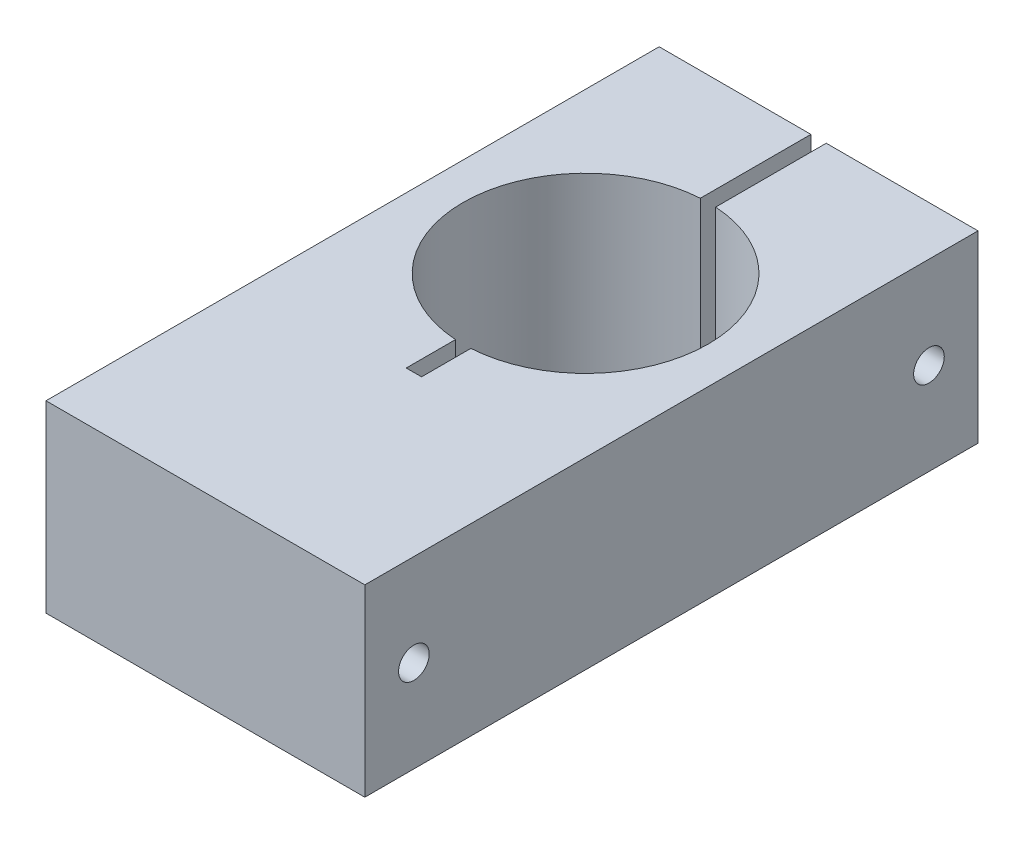
ISO-10303-21;
HEADER;
FILE_DESCRIPTION(('STEP AP214'),'2;1');
FILE_NAME('part.step','',(''),(''),'','','');
FILE_SCHEMA(('AUTOMOTIVE_DESIGN { 1 0 10303 214 1 1 1 1 }'));
ENDSEC;
DATA;
#1=APPLICATION_CONTEXT('core data for automotive mechanical design processes');
#2=APPLICATION_PROTOCOL_DEFINITION('international standard','automotive_design',2000,#1);
#3=PRODUCT_CONTEXT('',#1,'mechanical');
#4=PRODUCT('Part','Part','',(#3));
#5=PRODUCT_RELATED_PRODUCT_CATEGORY('part','',(#4));
#6=PRODUCT_DEFINITION_FORMATION('','',#4);
#7=PRODUCT_DEFINITION_CONTEXT('part definition',#1,'design');
#8=PRODUCT_DEFINITION('design','',#6,#7);
#9=PRODUCT_DEFINITION_SHAPE('','',#8);
#10=(LENGTH_UNIT() NAMED_UNIT(*) SI_UNIT(.MILLI.,.METRE.));
#11=(NAMED_UNIT(*) PLANE_ANGLE_UNIT() SI_UNIT($,.RADIAN.));
#12=(NAMED_UNIT(*) SI_UNIT($,.STERADIAN.) SOLID_ANGLE_UNIT());
#13=UNCERTAINTY_MEASURE_WITH_UNIT(LENGTH_MEASURE(1.E-05),#10,'distance_accuracy_value','');
#14=(GEOMETRIC_REPRESENTATION_CONTEXT(3) GLOBAL_UNCERTAINTY_ASSIGNED_CONTEXT((#13)) GLOBAL_UNIT_ASSIGNED_CONTEXT((#10,
#11,#12)) REPRESENTATION_CONTEXT('',''));
#15=CARTESIAN_POINT('',(0.,0.,0.));
#16=DIRECTION('',(0.,0.,1.));
#17=DIRECTION('',(1.,0.,0.));
#18=AXIS2_PLACEMENT_3D('',#15,#16,#17);
#19=CARTESIAN_POINT('',(0.79375,0.,-31.75));
#20=DIRECTION('',(1.,0.,0.));
#21=DIRECTION('',(0.,0.,-1.));
#22=AXIS2_PLACEMENT_3D('',#19,#20,#21);
#23=PLANE('',#22);
#24=CARTESIAN_POINT('',(0.793749999999999,9.525,-26.67));
#25=DIRECTION('',(1.,0.,0.));
#26=DIRECTION('',(0.,0.,-1.));
#27=AXIS2_PLACEMENT_3D('',#24,#25,#26);
#28=CIRCLE('',#27,1.5875);
#29=CARTESIAN_POINT('',(0.793749999999999,9.525,-28.2575));
#30=VERTEX_POINT('',#29);
#31=EDGE_CURVE('E223',#30,#30,#28,.T.);
#32=ORIENTED_EDGE('',*,*,#31,.T.);
#33=EDGE_LOOP('',(#32));
#34=FACE_BOUND('',#33,.T.);
#35=DIRECTION('',(0.,0.,-1.));
#36=VECTOR('',#35,1.);
#37=CARTESIAN_POINT('',(0.79375,0.,-31.75));
#38=LINE('',#37,#36);
#39=CARTESIAN_POINT('',(0.79375,0.,-20.2951710417454));
#40=VERTEX_POINT('',#39);
#41=CARTESIAN_POINT('',(0.79375,0.,-31.75));
#42=VERTEX_POINT('',#41);
#43=EDGE_CURVE('E210',#40,#42,#38,.T.);
#44=ORIENTED_EDGE('',*,*,#43,.F.);
#45=DIRECTION('',(0.,1.,0.));
#46=VECTOR('',#45,1.);
#47=CARTESIAN_POINT('',(0.79375,0.,-20.2951710417454));
#48=LINE('',#47,#46);
#49=CARTESIAN_POINT('',(0.79375,19.05,-20.2951710417454));
#50=VERTEX_POINT('',#49);
#51=EDGE_CURVE('E129',#40,#50,#48,.T.);
#52=ORIENTED_EDGE('',*,*,#51,.T.);
#53=DIRECTION('',(0.,0.,-1.));
#54=VECTOR('',#53,1.);
#55=CARTESIAN_POINT('',(0.79375,19.05,-31.75));
#56=LINE('',#55,#54);
#57=CARTESIAN_POINT('',(0.79375,19.05,-31.75));
#58=VERTEX_POINT('',#57);
#59=EDGE_CURVE('E138',#50,#58,#56,.T.);
#60=ORIENTED_EDGE('',*,*,#59,.T.);
#61=DIRECTION('',(0.,1.,0.));
#62=VECTOR('',#61,1.);
#63=CARTESIAN_POINT('',(0.79375,0.,-31.75));
#64=LINE('',#63,#62);
#65=EDGE_CURVE('E152',#42,#58,#64,.T.);
#66=ORIENTED_EDGE('',*,*,#65,.F.);
#67=EDGE_LOOP('',(#44,#52,#60,#66));
#68=FACE_BOUND('',#67,.T.);
#69=ADVANCED_FACE('F33',(#34,#68),#23,.F.);
#70=CARTESIAN_POINT('',(-0.79375,0.,-31.75));
#71=DIRECTION('',(-1.,0.,0.));
#72=DIRECTION('',(0.,0.,1.));
#73=AXIS2_PLACEMENT_3D('',#70,#71,#72);
#74=PLANE('',#73);
#75=DIRECTION('',(0.,0.,1.));
#76=VECTOR('',#75,1.);
#77=CARTESIAN_POINT('',(-0.79375,0.,-31.75));
#78=LINE('',#77,#76);
#79=CARTESIAN_POINT('',(-0.793749999999996,0.,5.05517104174533));
#80=VERTEX_POINT('',#79);
#81=CARTESIAN_POINT('',(-0.793749999999995,0.,10.16));
#82=VERTEX_POINT('',#81);
#83=EDGE_CURVE('E144',#80,#82,#78,.T.);
#84=ORIENTED_EDGE('',*,*,#83,.F.);
#85=DIRECTION('',(0.,1.,0.));
#86=VECTOR('',#85,1.);
#87=CARTESIAN_POINT('',(-0.793749999999995,0.,5.05517104174533));
#88=LINE('',#87,#86);
#89=CARTESIAN_POINT('',(-0.793749999999996,19.05,5.05517104174533));
#90=VERTEX_POINT('',#89);
#91=EDGE_CURVE('E11',#80,#90,#88,.T.);
#92=ORIENTED_EDGE('',*,*,#91,.T.);
#93=DIRECTION('',(0.,0.,1.));
#94=VECTOR('',#93,1.);
#95=CARTESIAN_POINT('',(-0.79375,19.05,-31.75));
#96=LINE('',#95,#94);
#97=CARTESIAN_POINT('',(-0.793749999999995,19.05,10.16));
#98=VERTEX_POINT('',#97);
#99=EDGE_CURVE('E214',#90,#98,#96,.T.);
#100=ORIENTED_EDGE('',*,*,#99,.T.);
#101=DIRECTION('',(0.,1.,0.));
#102=VECTOR('',#101,1.);
#103=CARTESIAN_POINT('',(-0.793749999999995,0.,10.16));
#104=LINE('',#103,#102);
#105=EDGE_CURVE('E157',#82,#98,#104,.T.);
#106=ORIENTED_EDGE('',*,*,#105,.F.);
#107=EDGE_LOOP('',(#84,#92,#100,#106));
#108=FACE_BOUND('',#107,.T.);
#109=ADVANCED_FACE('F264',(#108),#74,.F.);
#110=CARTESIAN_POINT('',(-16.51,19.05,-31.75));
#111=DIRECTION('',(0.,0.,1.));
#112=DIRECTION('',(1.,0.,0.));
#113=AXIS2_PLACEMENT_3D('',#110,#111,#112);
#114=PLANE('',#113);
#115=DIRECTION('',(-1.,0.,0.));
#116=VECTOR('',#115,1.);
#117=CARTESIAN_POINT('',(-16.51,0.,-31.75));
#118=LINE('',#117,#116);
#119=CARTESIAN_POINT('',(16.51,0.,-31.75));
#120=VERTEX_POINT('',#119);
#121=EDGE_CURVE('E178',#120,#42,#118,.T.);
#122=ORIENTED_EDGE('',*,*,#121,.T.);
#123=ORIENTED_EDGE('',*,*,#65,.T.);
#124=DIRECTION('',(-1.,0.,0.));
#125=VECTOR('',#124,1.);
#126=CARTESIAN_POINT('',(-16.51,19.05,-31.75));
#127=LINE('',#126,#125);
#128=CARTESIAN_POINT('',(16.51,19.05,-31.75));
#129=VERTEX_POINT('',#128);
#130=EDGE_CURVE('E168',#129,#58,#127,.T.);
#131=ORIENTED_EDGE('',*,*,#130,.F.);
#132=DIRECTION('',(0.,-1.,0.));
#133=VECTOR('',#132,1.);
#134=CARTESIAN_POINT('',(16.51,19.05,-31.75));
#135=LINE('',#134,#133);
#136=EDGE_CURVE('E192',#129,#120,#135,.T.);
#137=ORIENTED_EDGE('',*,*,#136,.T.);
#138=EDGE_LOOP('',(#122,#123,#131,#137));
#139=FACE_BOUND('',#138,.T.);
#140=ADVANCED_FACE('F244',(#139),#114,.F.);
#141=CARTESIAN_POINT('',(16.51,19.05,-31.75));
#142=DIRECTION('',(-1.,0.,0.));
#143=DIRECTION('',(0.,0.,1.));
#144=AXIS2_PLACEMENT_3D('',#141,#142,#143);
#145=PLANE('',#144);
#146=CARTESIAN_POINT('',(16.51,9.525,26.67));
#147=DIRECTION('',(1.,0.,0.));
#148=DIRECTION('',(0.,0.,-1.));
#149=AXIS2_PLACEMENT_3D('',#146,#147,#148);
#150=CIRCLE('',#149,1.5875);
#151=CARTESIAN_POINT('',(16.51,9.525,25.0825));
#152=VERTEX_POINT('',#151);
#153=EDGE_CURVE('E229',#152,#152,#150,.T.);
#154=ORIENTED_EDGE('',*,*,#153,.F.);
#155=EDGE_LOOP('',(#154));
#156=FACE_BOUND('',#155,.T.);
#157=CARTESIAN_POINT('',(16.51,9.525,-26.67));
#158=DIRECTION('',(1.,0.,0.));
#159=DIRECTION('',(0.,0.,-1.));
#160=AXIS2_PLACEMENT_3D('',#157,#158,#159);
#161=CIRCLE('',#160,1.5875);
#162=CARTESIAN_POINT('',(16.51,9.525,-28.2575));
#163=VERTEX_POINT('',#162);
#164=EDGE_CURVE('E230',#163,#163,#161,.T.);
#165=ORIENTED_EDGE('',*,*,#164,.F.);
#166=EDGE_LOOP('',(#165));
#167=FACE_BOUND('',#166,.T.);
#168=DIRECTION('',(0.,0.,-1.));
#169=VECTOR('',#168,1.);
#170=CARTESIAN_POINT('',(16.51,0.,-31.75));
#171=LINE('',#170,#169);
#172=CARTESIAN_POINT('',(16.51,0.,31.75));
#173=VERTEX_POINT('',#172);
#174=EDGE_CURVE('E155',#173,#120,#171,.T.);
#175=ORIENTED_EDGE('',*,*,#174,.T.);
#176=ORIENTED_EDGE('',*,*,#136,.F.);
#177=DIRECTION('',(0.,0.,-1.));
#178=VECTOR('',#177,1.);
#179=CARTESIAN_POINT('',(16.51,19.05,-31.75));
#180=LINE('',#179,#178);
#181=CARTESIAN_POINT('',(16.51,19.05,31.75));
#182=VERTEX_POINT('',#181);
#183=EDGE_CURVE('E163',#182,#129,#180,.T.);
#184=ORIENTED_EDGE('',*,*,#183,.F.);
#185=DIRECTION('',(0.,-1.,0.));
#186=VECTOR('',#185,1.);
#187=CARTESIAN_POINT('',(16.51,19.05,31.75));
#188=LINE('',#187,#186);
#189=EDGE_CURVE('E174',#182,#173,#188,.T.);
#190=ORIENTED_EDGE('',*,*,#189,.T.);
#191=EDGE_LOOP('',(#175,#176,#184,#190));
#192=FACE_BOUND('',#191,.T.);
#193=ADVANCED_FACE('F35',(#156,#167,#192),#145,.F.);
#194=CARTESIAN_POINT('',(-0.79375,19.05,-31.75));
#195=VERTEX_POINT('',#194);
#196=CARTESIAN_POINT('',(-16.51,19.05,-31.75));
#197=VERTEX_POINT('',#196);
#198=EDGE_CURVE('E166',#195,#197,#127,.T.);
#199=ORIENTED_EDGE('',*,*,#198,.F.);
#200=DIRECTION('',(0.,1.,0.));
#201=VECTOR('',#200,1.);
#202=CARTESIAN_POINT('',(-0.79375,0.,-31.75));
#203=LINE('',#202,#201);
#204=CARTESIAN_POINT('',(-0.79375,0.,-31.75));
#205=VERTEX_POINT('',#204);
#206=EDGE_CURVE('E160',#205,#195,#203,.T.);
#207=ORIENTED_EDGE('',*,*,#206,.F.);
#208=CARTESIAN_POINT('',(-16.51,0.,-31.75));
#209=VERTEX_POINT('',#208);
#210=EDGE_CURVE('E177',#205,#209,#118,.T.);
#211=ORIENTED_EDGE('',*,*,#210,.T.);
#212=DIRECTION('',(0.,-1.,0.));
#213=VECTOR('',#212,1.);
#214=CARTESIAN_POINT('',(-16.51,19.05,-31.75));
#215=LINE('',#214,#213);
#216=EDGE_CURVE('E189',#197,#209,#215,.T.);
#217=ORIENTED_EDGE('',*,*,#216,.F.);
#218=EDGE_LOOP('',(#199,#207,#211,#217));
#219=FACE_BOUND('',#218,.T.);
#220=ADVANCED_FACE('F243',(#219),#114,.F.);
#221=CARTESIAN_POINT('',(-16.51,19.05,-31.75));
#222=DIRECTION('',(1.,0.,0.));
#223=DIRECTION('',(0.,0.,-1.));
#224=AXIS2_PLACEMENT_3D('',#221,#222,#223);
#225=PLANE('',#224);
#226=CARTESIAN_POINT('',(-16.51,9.525,26.67));
#227=DIRECTION('',(1.,0.,0.));
#228=DIRECTION('',(0.,0.,-1.));
#229=AXIS2_PLACEMENT_3D('',#226,#227,#228);
#230=CIRCLE('',#229,1.5875);
#231=CARTESIAN_POINT('',(-16.51,9.525,25.0825));
#232=VERTEX_POINT('',#231);
#233=EDGE_CURVE('E233',#232,#232,#230,.F.);
#234=ORIENTED_EDGE('',*,*,#233,.F.);
#235=EDGE_LOOP('',(#234));
#236=FACE_BOUND('',#235,.T.);
#237=CARTESIAN_POINT('',(-16.51,9.525,-26.67));
#238=DIRECTION('',(1.,0.,0.));
#239=DIRECTION('',(0.,0.,-1.));
#240=AXIS2_PLACEMENT_3D('',#237,#238,#239);
#241=CIRCLE('',#240,1.5875);
#242=CARTESIAN_POINT('',(-16.51,9.525,-28.2575));
#243=VERTEX_POINT('',#242);
#244=EDGE_CURVE('E226',#243,#243,#241,.F.);
#245=ORIENTED_EDGE('',*,*,#244,.F.);
#246=EDGE_LOOP('',(#245));
#247=FACE_BOUND('',#246,.T.);
#248=DIRECTION('',(0.,0.,1.));
#249=VECTOR('',#248,1.);
#250=CARTESIAN_POINT('',(-16.51,0.,-31.75));
#251=LINE('',#250,#249);
#252=CARTESIAN_POINT('',(-16.51,0.,31.75));
#253=VERTEX_POINT('',#252);
#254=EDGE_CURVE('E181',#209,#253,#251,.T.);
#255=ORIENTED_EDGE('',*,*,#254,.T.);
#256=DIRECTION('',(0.,-1.,0.));
#257=VECTOR('',#256,1.);
#258=CARTESIAN_POINT('',(-16.51,19.05,31.75));
#259=LINE('',#258,#257);
#260=CARTESIAN_POINT('',(-16.51,19.05,31.75));
#261=VERTEX_POINT('',#260);
#262=EDGE_CURVE('E186',#261,#253,#259,.T.);
#263=ORIENTED_EDGE('',*,*,#262,.F.);
#264=DIRECTION('',(0.,0.,1.));
#265=VECTOR('',#264,1.);
#266=CARTESIAN_POINT('',(-16.51,19.05,-31.75));
#267=LINE('',#266,#265);
#268=EDGE_CURVE('E170',#197,#261,#267,.T.);
#269=ORIENTED_EDGE('',*,*,#268,.F.);
#270=ORIENTED_EDGE('',*,*,#216,.T.);
#271=EDGE_LOOP('',(#255,#263,#269,#270));
#272=FACE_BOUND('',#271,.T.);
#273=ADVANCED_FACE('F259',(#236,#247,#272),#225,.F.);
#274=CARTESIAN_POINT('',(-16.51,19.05,31.75));
#275=DIRECTION('',(0.,0.,-1.));
#276=DIRECTION('',(-1.,0.,0.));
#277=AXIS2_PLACEMENT_3D('',#274,#275,#276);
#278=PLANE('',#277);
#279=DIRECTION('',(1.,0.,0.));
#280=VECTOR('',#279,1.);
#281=CARTESIAN_POINT('',(-16.51,0.,31.75));
#282=LINE('',#281,#280);
#283=EDGE_CURVE('E167',#253,#173,#282,.T.);
#284=ORIENTED_EDGE('',*,*,#283,.T.);
#285=ORIENTED_EDGE('',*,*,#189,.F.);
#286=DIRECTION('',(1.,0.,0.));
#287=VECTOR('',#286,1.);
#288=CARTESIAN_POINT('',(-16.51,19.05,31.75));
#289=LINE('',#288,#287);
#290=EDGE_CURVE('E172',#261,#182,#289,.T.);
#291=ORIENTED_EDGE('',*,*,#290,.F.);
#292=ORIENTED_EDGE('',*,*,#262,.T.);
#293=EDGE_LOOP('',(#284,#285,#291,#292));
#294=FACE_BOUND('',#293,.T.);
#295=ADVANCED_FACE('F257',(#294),#278,.F.);
#296=CARTESIAN_POINT('',(0.,19.05,0.));
#297=DIRECTION('',(0.,1.,0.));
#298=DIRECTION('',(0.,0.,1.));
#299=AXIS2_PLACEMENT_3D('',#296,#297,#298);
#300=PLANE('',#299);
#301=CARTESIAN_POINT('',(0.,19.05,-7.62000000000002));
#302=DIRECTION('',(0.,1.,0.));
#303=DIRECTION('',(0.,0.,1.));
#304=AXIS2_PLACEMENT_3D('',#301,#302,#303);
#305=CIRCLE('',#304,12.7);
#306=CARTESIAN_POINT('',(0.79375,19.05,5.05517104174533));
#307=VERTEX_POINT('',#306);
#308=EDGE_CURVE('E123',#307,#50,#305,.T.);
#309=ORIENTED_EDGE('',*,*,#308,.F.);
#310=CARTESIAN_POINT('',(0.79375,19.05,10.16));
#311=VERTEX_POINT('',#310);
#312=EDGE_CURVE('E136',#311,#307,#56,.T.);
#313=ORIENTED_EDGE('',*,*,#312,.F.);
#314=DIRECTION('',(1.,0.,0.));
#315=VECTOR('',#314,1.);
#316=CARTESIAN_POINT('',(-0.793749999999995,19.05,10.16));
#317=LINE('',#316,#315);
#318=EDGE_CURVE('E148',#98,#311,#317,.T.);
#319=ORIENTED_EDGE('',*,*,#318,.F.);
#320=ORIENTED_EDGE('',*,*,#99,.F.);
#321=CARTESIAN_POINT('',(-0.793749999999999,19.05,-20.2951710417454));
#322=VERTEX_POINT('',#321);
#323=EDGE_CURVE('E139',#322,#90,#305,.T.);
#324=ORIENTED_EDGE('',*,*,#323,.F.);
#325=EDGE_CURVE('E201',#195,#322,#96,.T.);
#326=ORIENTED_EDGE('',*,*,#325,.F.);
#327=ORIENTED_EDGE('',*,*,#198,.T.);
#328=ORIENTED_EDGE('',*,*,#268,.T.);
#329=ORIENTED_EDGE('',*,*,#290,.T.);
#330=ORIENTED_EDGE('',*,*,#183,.T.);
#331=ORIENTED_EDGE('',*,*,#130,.T.);
#332=ORIENTED_EDGE('',*,*,#59,.F.);
#333=EDGE_LOOP('',(#309,#313,#319,#320,#324,#326,#327,#328,#329,#330,#331,#332));
#334=FACE_BOUND('',#333,.T.);
#335=ADVANCED_FACE('F134',(#334),#300,.T.);
#336=CARTESIAN_POINT('',(0.,0.,0.));
#337=DIRECTION('',(0.,1.,0.));
#338=DIRECTION('',(0.,0.,1.));
#339=AXIS2_PLACEMENT_3D('',#336,#337,#338);
#340=PLANE('',#339);
#341=CARTESIAN_POINT('',(0.79375,0.,10.16));
#342=VERTEX_POINT('',#341);
#343=CARTESIAN_POINT('',(0.79375,0.,5.05517104174533));
#344=VERTEX_POINT('',#343);
#345=EDGE_CURVE('E162',#342,#344,#38,.T.);
#346=ORIENTED_EDGE('',*,*,#345,.T.);
#347=CARTESIAN_POINT('',(0.,0.,-7.62000000000002));
#348=DIRECTION('',(0.,1.,0.));
#349=DIRECTION('',(0.,0.,1.));
#350=AXIS2_PLACEMENT_3D('',#347,#348,#349);
#351=CIRCLE('',#350,12.7);
#352=EDGE_CURVE('E49',#344,#40,#351,.T.);
#353=ORIENTED_EDGE('',*,*,#352,.T.);
#354=ORIENTED_EDGE('',*,*,#43,.T.);
#355=ORIENTED_EDGE('',*,*,#121,.F.);
#356=ORIENTED_EDGE('',*,*,#174,.F.);
#357=ORIENTED_EDGE('',*,*,#283,.F.);
#358=ORIENTED_EDGE('',*,*,#254,.F.);
#359=ORIENTED_EDGE('',*,*,#210,.F.);
#360=CARTESIAN_POINT('',(-0.793749999999999,0.,-20.2951710417454));
#361=VERTEX_POINT('',#360);
#362=EDGE_CURVE('E146',#205,#361,#78,.T.);
#363=ORIENTED_EDGE('',*,*,#362,.T.);
#364=EDGE_CURVE('E57',#361,#80,#351,.T.);
#365=ORIENTED_EDGE('',*,*,#364,.T.);
#366=ORIENTED_EDGE('',*,*,#83,.T.);
#367=DIRECTION('',(1.,0.,0.));
#368=VECTOR('',#367,1.);
#369=CARTESIAN_POINT('',(-0.793749999999995,0.,10.16));
#370=LINE('',#369,#368);
#371=EDGE_CURVE('E208',#82,#342,#370,.T.);
#372=ORIENTED_EDGE('',*,*,#371,.T.);
#373=EDGE_LOOP('',(#346,#353,#354,#355,#356,#357,#358,#359,#363,#365,#366,#372));
#374=FACE_BOUND('',#373,.T.);
#375=ADVANCED_FACE('F205',(#374),#340,.F.);
#376=ORIENTED_EDGE('',*,*,#312,.T.);
#377=DIRECTION('',(0.,1.,0.));
#378=VECTOR('',#377,1.);
#379=CARTESIAN_POINT('',(0.79375,0.,5.05517104174533));
#380=LINE('',#379,#378);
#381=EDGE_CURVE('E120',#307,#344,#380,.F.);
#382=ORIENTED_EDGE('',*,*,#381,.T.);
#383=ORIENTED_EDGE('',*,*,#345,.F.);
#384=DIRECTION('',(0.,1.,0.));
#385=VECTOR('',#384,1.);
#386=CARTESIAN_POINT('',(0.79375,0.,10.16));
#387=LINE('',#386,#385);
#388=EDGE_CURVE('E142',#342,#311,#387,.T.);
#389=ORIENTED_EDGE('',*,*,#388,.T.);
#390=EDGE_LOOP('',(#376,#382,#383,#389));
#391=FACE_BOUND('',#390,.T.);
#392=ADVANCED_FACE('F141',(#391),#23,.F.);
#393=CARTESIAN_POINT('',(-0.793749999999995,0.,10.16));
#394=DIRECTION('',(0.,0.,1.));
#395=DIRECTION('',(1.,0.,0.));
#396=AXIS2_PLACEMENT_3D('',#393,#394,#395);
#397=PLANE('',#396);
#398=ORIENTED_EDGE('',*,*,#318,.T.);
#399=ORIENTED_EDGE('',*,*,#388,.F.);
#400=ORIENTED_EDGE('',*,*,#371,.F.);
#401=ORIENTED_EDGE('',*,*,#105,.T.);
#402=EDGE_LOOP('',(#398,#399,#400,#401));
#403=FACE_BOUND('',#402,.T.);
#404=ADVANCED_FACE('F267',(#403),#397,.F.);
#405=CARTESIAN_POINT('',(-0.793749999999999,9.525,-26.67));
#406=DIRECTION('',(-1.,0.,0.));
#407=DIRECTION('',(0.,0.,1.));
#408=AXIS2_PLACEMENT_3D('',#405,#406,#407);
#409=CIRCLE('',#408,1.5875);
#410=CARTESIAN_POINT('',(-0.793749999999999,9.525,-25.0825));
#411=VERTEX_POINT('',#410);
#412=EDGE_CURVE('E37',#411,#411,#409,.T.);
#413=ORIENTED_EDGE('',*,*,#412,.T.);
#414=EDGE_LOOP('',(#413));
#415=FACE_BOUND('',#414,.T.);
#416=ORIENTED_EDGE('',*,*,#325,.T.);
#417=DIRECTION('',(0.,1.,0.));
#418=VECTOR('',#417,1.);
#419=CARTESIAN_POINT('',(-0.793749999999998,0.,-20.2951710417454));
#420=LINE('',#419,#418);
#421=EDGE_CURVE('E42',#322,#361,#420,.F.);
#422=ORIENTED_EDGE('',*,*,#421,.T.);
#423=ORIENTED_EDGE('',*,*,#362,.F.);
#424=ORIENTED_EDGE('',*,*,#206,.T.);
#425=EDGE_LOOP('',(#416,#422,#423,#424));
#426=FACE_BOUND('',#425,.T.);
#427=ADVANCED_FACE('F198',(#415,#426),#74,.F.);
#428=CARTESIAN_POINT('',(0.,0.,-7.62000000000002));
#429=DIRECTION('',(0.,1.,0.));
#430=DIRECTION('',(0.,0.,1.));
#431=AXIS2_PLACEMENT_3D('',#428,#429,#430);
#432=CYLINDRICAL_SURFACE('',#431,12.7);
#433=ORIENTED_EDGE('',*,*,#364,.F.);
#434=ORIENTED_EDGE('',*,*,#421,.F.);
#435=ORIENTED_EDGE('',*,*,#323,.T.);
#436=ORIENTED_EDGE('',*,*,#91,.F.);
#437=EDGE_LOOP('',(#433,#434,#435,#436));
#438=FACE_BOUND('',#437,.T.);
#439=ADVANCED_FACE('F263',(#438),#432,.F.);
#440=ORIENTED_EDGE('',*,*,#352,.F.);
#441=ORIENTED_EDGE('',*,*,#381,.F.);
#442=ORIENTED_EDGE('',*,*,#308,.T.);
#443=ORIENTED_EDGE('',*,*,#51,.F.);
#444=EDGE_LOOP('',(#440,#441,#442,#443));
#445=FACE_BOUND('',#444,.T.);
#446=ADVANCED_FACE('F122',(#445),#432,.F.);
#447=CARTESIAN_POINT('',(-21.0001280605346,9.525,-26.67));
#448=DIRECTION('',(1.,0.,0.));
#449=DIRECTION('',(0.,0.,-1.));
#450=AXIS2_PLACEMENT_3D('',#447,#448,#449);
#451=CYLINDRICAL_SURFACE('',#450,1.5875);
#452=ORIENTED_EDGE('',*,*,#244,.T.);
#453=EDGE_LOOP('',(#452));
#454=FACE_BOUND('',#453,.T.);
#455=ORIENTED_EDGE('',*,*,#412,.F.);
#456=EDGE_LOOP('',(#455));
#457=FACE_BOUND('',#456,.T.);
#458=ADVANCED_FACE('F285',(#454,#457),#451,.F.);
#459=CARTESIAN_POINT('',(-21.0001280605346,9.525,26.67));
#460=DIRECTION('',(1.,0.,0.));
#461=DIRECTION('',(0.,0.,-1.));
#462=AXIS2_PLACEMENT_3D('',#459,#460,#461);
#463=CYLINDRICAL_SURFACE('',#462,1.5875);
#464=ORIENTED_EDGE('',*,*,#233,.T.);
#465=EDGE_LOOP('',(#464));
#466=FACE_BOUND('',#465,.T.);
#467=ORIENTED_EDGE('',*,*,#153,.T.);
#468=EDGE_LOOP('',(#467));
#469=FACE_BOUND('',#468,.T.);
#470=ADVANCED_FACE('F239',(#466,#469),#463,.F.);
#471=ORIENTED_EDGE('',*,*,#164,.T.);
#472=EDGE_LOOP('',(#471));
#473=FACE_BOUND('',#472,.T.);
#474=ORIENTED_EDGE('',*,*,#31,.F.);
#475=EDGE_LOOP('',(#474));
#476=FACE_BOUND('',#475,.T.);
#477=ADVANCED_FACE('F286',(#473,#476),#451,.F.);
#478=CLOSED_SHELL('',(#69,#109,#140,#193,#220,#273,#295,#335,#375,#392,#404,#427,#439,#446,#458,
#470,#477));
#479=MANIFOLD_SOLID_BREP('B2',#478);
#480=ADVANCED_BREP_SHAPE_REPRESENTATION('',(#18,#479),#14);
#481=SHAPE_DEFINITION_REPRESENTATION(#9,#480);
ENDSEC;
END-ISO-10303-21;
